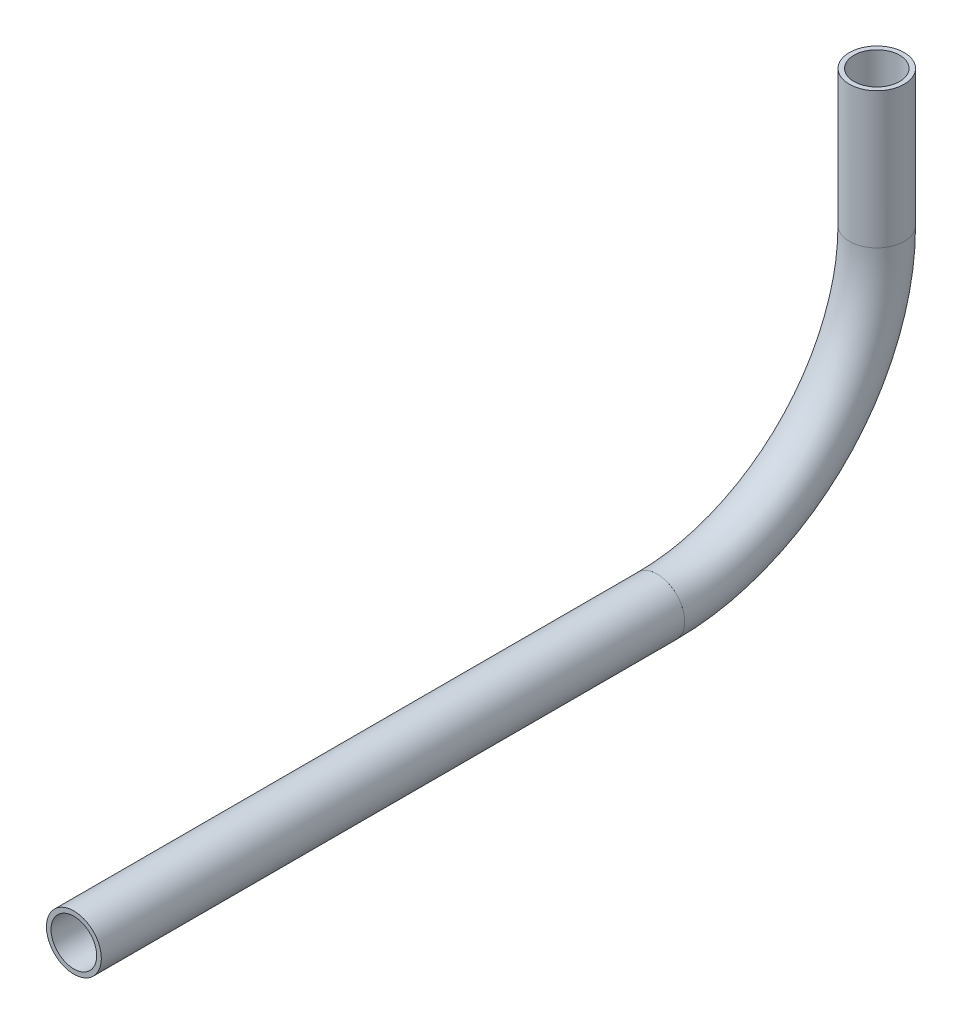
ISO-10303-21;
HEADER;
FILE_DESCRIPTION(('STEP AP214'),'2;1');
FILE_NAME('part.step','',(''),(''),'','','');
FILE_SCHEMA(('AUTOMOTIVE_DESIGN { 1 0 10303 214 1 1 1 1 }'));
ENDSEC;
DATA;
#1=APPLICATION_CONTEXT('core data for automotive mechanical design processes');
#2=APPLICATION_PROTOCOL_DEFINITION('international standard','automotive_design',2000,#1);
#3=PRODUCT_CONTEXT('',#1,'mechanical');
#4=PRODUCT('Part','Part','',(#3));
#5=PRODUCT_RELATED_PRODUCT_CATEGORY('part','',(#4));
#6=PRODUCT_DEFINITION_FORMATION('','',#4);
#7=PRODUCT_DEFINITION_CONTEXT('part definition',#1,'design');
#8=PRODUCT_DEFINITION('design','',#6,#7);
#9=PRODUCT_DEFINITION_SHAPE('','',#8);
#10=(LENGTH_UNIT() NAMED_UNIT(*) SI_UNIT(.MILLI.,.METRE.));
#11=(NAMED_UNIT(*) PLANE_ANGLE_UNIT() SI_UNIT($,.RADIAN.));
#12=(NAMED_UNIT(*) SI_UNIT($,.STERADIAN.) SOLID_ANGLE_UNIT());
#13=UNCERTAINTY_MEASURE_WITH_UNIT(LENGTH_MEASURE(1.E-05),#10,'distance_accuracy_value','');
#14=(GEOMETRIC_REPRESENTATION_CONTEXT(3) GLOBAL_UNCERTAINTY_ASSIGNED_CONTEXT((#13)) GLOBAL_UNIT_ASSIGNED_CONTEXT((#10,
#11,#12)) REPRESENTATION_CONTEXT('',''));
#15=CARTESIAN_POINT('',(0.,0.,0.));
#16=DIRECTION('',(0.,0.,1.));
#17=DIRECTION('',(1.,0.,0.));
#18=AXIS2_PLACEMENT_3D('',#15,#16,#17);
#19=CARTESIAN_POINT('',(0.,670.165576631268,168.173580131087));
#20=DIRECTION('',(0.,0.,1.));
#21=DIRECTION('',(0.,-1.,0.));
#22=AXIS2_PLACEMENT_3D('',#19,#20,#21);
#23=CYLINDRICAL_SURFACE('',#22,5.28320000000004);
#24=CARTESIAN_POINT('',(0.,670.165576631268,303.16459571102));
#25=DIRECTION('',(0.,0.,-1.));
#26=DIRECTION('',(0.,1.,0.));
#27=AXIS2_PLACEMENT_3D('',#24,#25,#26);
#28=CIRCLE('',#27,5.28320000000004);
#29=CARTESIAN_POINT('',(0.,675.448776631268,303.16459571102));
#30=VERTEX_POINT('',#29);
#31=EDGE_CURVE('E61',#30,#30,#28,.T.);
#32=ORIENTED_EDGE('',*,*,#31,.F.);
#33=EDGE_LOOP('',(#32));
#34=FACE_BOUND('',#33,.T.);
#35=CARTESIAN_POINT('',(0.,670.165576631268,168.173580131087));
#36=DIRECTION('',(0.,0.,-1.));
#37=DIRECTION('',(0.,1.,0.));
#38=AXIS2_PLACEMENT_3D('',#35,#36,#37);
#39=CIRCLE('',#38,5.28320000000004);
#40=CARTESIAN_POINT('',(0.,675.448776631268,168.173580131087));
#41=VERTEX_POINT('',#40);
#42=EDGE_CURVE('E57',#41,#41,#39,.T.);
#43=ORIENTED_EDGE('',*,*,#42,.T.);
#44=EDGE_LOOP('',(#43));
#45=FACE_BOUND('',#44,.T.);
#46=ADVANCED_FACE('F53',(#34,#45),#23,.F.);
#47=CARTESIAN_POINT('',(0.,670.165576631268,168.173580131087));
#48=DIRECTION('',(0.,0.,1.));
#49=DIRECTION('',(0.,-1.,0.));
#50=AXIS2_PLACEMENT_3D('',#47,#48,#49);
#51=CYLINDRICAL_SURFACE('',#50,6.35000000000005);
#52=CARTESIAN_POINT('',(0.,670.165576631268,303.16459571102));
#53=DIRECTION('',(0.,0.,-1.));
#54=DIRECTION('',(0.,1.,0.));
#55=AXIS2_PLACEMENT_3D('',#52,#53,#54);
#56=CIRCLE('',#55,6.35000000000005);
#57=CARTESIAN_POINT('',(0.,676.515576631268,303.16459571102));
#58=VERTEX_POINT('',#57);
#59=EDGE_CURVE('E65',#58,#58,#56,.T.);
#60=ORIENTED_EDGE('',*,*,#59,.T.);
#61=EDGE_LOOP('',(#60));
#62=FACE_BOUND('',#61,.T.);
#63=CARTESIAN_POINT('',(0.,670.165576631268,168.173580131087));
#64=DIRECTION('',(0.,0.,-1.));
#65=DIRECTION('',(0.,1.,0.));
#66=AXIS2_PLACEMENT_3D('',#63,#64,#65);
#67=CIRCLE('',#66,6.35000000000005);
#68=CARTESIAN_POINT('',(0.,676.515576631268,168.173580131087));
#69=VERTEX_POINT('',#68);
#70=EDGE_CURVE('E12',#69,#69,#67,.T.);
#71=ORIENTED_EDGE('',*,*,#70,.F.);
#72=EDGE_LOOP('',(#71));
#73=FACE_BOUND('',#72,.T.);
#74=ADVANCED_FACE('F80',(#62,#73),#51,.T.);
#75=CARTESIAN_POINT('',(0.,670.165576631268,303.16459571102));
#76=DIRECTION('',(0.,0.,-1.));
#77=DIRECTION('',(0.,1.,0.));
#78=AXIS2_PLACEMENT_3D('',#75,#76,#77);
#79=PLANE('',#78);
#80=ORIENTED_EDGE('',*,*,#31,.T.);
#81=EDGE_LOOP('',(#80));
#82=FACE_BOUND('',#81,.T.);
#83=ORIENTED_EDGE('',*,*,#59,.F.);
#84=EDGE_LOOP('',(#83));
#85=FACE_BOUND('',#84,.T.);
#86=ADVANCED_FACE('F76',(#82,#85),#79,.F.);
#87=CARTESIAN_POINT('',(0.,670.165576631268,168.173580131087));
#88=DIRECTION('',(0.,0.,-1.));
#89=DIRECTION('',(0.,1.,0.));
#90=AXIS2_PLACEMENT_3D('',#87,#88,#89);
#91=PLANE('',#90);
#92=ORIENTED_EDGE('',*,*,#42,.F.);
#93=EDGE_LOOP('',(#92));
#94=FACE_BOUND('',#93,.T.);
#95=ORIENTED_EDGE('',*,*,#70,.T.);
#96=EDGE_LOOP('',(#95));
#97=FACE_BOUND('',#96,.T.);
#98=ADVANCED_FACE('F55',(#94,#97),#91,.T.);
#99=CLOSED_SHELL('',(#46,#74,#86,#98));
#100=MANIFOLD_SOLID_BREP('B2',#99);
#101=CARTESIAN_POINT('',(0.,720.965576631268,168.173580131087));
#102=DIRECTION('',(-1.,0.,0.));
#103=DIRECTION('',(0.,0.,1.));
#104=AXIS2_PLACEMENT_3D('',#101,#102,#103);
#105=TOROIDAL_SURFACE('',#104,50.8000000000001,5.28320000000004);
#106=CARTESIAN_POINT('',(0.,720.965576631268,117.373580131087));
#107=DIRECTION('',(0.,1.,0.));
#108=DIRECTION('',(0.,0.,1.));
#109=AXIS2_PLACEMENT_3D('',#106,#107,#108);
#110=CIRCLE('',#109,5.28320000000004);
#111=CARTESIAN_POINT('',(0.,720.965576631268,112.090380131087));
#112=VERTEX_POINT('',#111);
#113=EDGE_CURVE('E164',#112,#112,#110,.T.);
#114=CARTESIAN_POINT('',(0.,670.165576631268,168.173580131087));
#115=DIRECTION('',(0.,0.,1.));
#116=DIRECTION('',(0.,-1.,0.));
#117=AXIS2_PLACEMENT_3D('',#114,#115,#116);
#118=CIRCLE('',#117,5.28320000000004);
#119=CARTESIAN_POINT('',(0.,664.882376631268,168.173580131087));
#120=VERTEX_POINT('',#119);
#121=EDGE_CURVE('E154',#120,#120,#118,.T.);
#122=CARTESIAN_POINT('',(0.,720.965576631268,168.173580131087));
#123=DIRECTION('',(-1.,0.,0.));
#124=DIRECTION('',(0.,0.,1.));
#125=AXIS2_PLACEMENT_3D('',#122,#123,#124);
#126=CIRCLE('',#125,56.0832000000001);
#127=EDGE_CURVE('',#112,#120,#126,.T.);
#128=ORIENTED_EDGE('',*,*,#113,.T.);
#129=ORIENTED_EDGE('',*,*,#121,.T.);
#130=ORIENTED_EDGE('',*,*,#127,.T.);
#131=ORIENTED_EDGE('',*,*,#127,.F.);
#132=EDGE_LOOP('',(#128,#130,#129,#131));
#133=FACE_BOUND('',#132,.T.);
#134=ADVANCED_FACE('F150',(#133),#105,.F.);
#135=CARTESIAN_POINT('',(0.,720.965576631268,168.173580131087));
#136=DIRECTION('',(-1.,0.,0.));
#137=DIRECTION('',(0.,0.,1.));
#138=AXIS2_PLACEMENT_3D('',#135,#136,#137);
#139=TOROIDAL_SURFACE('',#138,50.8000000000001,6.35000000000005);
#140=CARTESIAN_POINT('',(0.,720.965576631268,117.373580131087));
#141=DIRECTION('',(0.,1.,0.));
#142=DIRECTION('',(0.,0.,1.));
#143=AXIS2_PLACEMENT_3D('',#140,#141,#142);
#144=CIRCLE('',#143,6.35000000000005);
#145=CARTESIAN_POINT('',(0.,720.965576631268,111.023580131087));
#146=VERTEX_POINT('',#145);
#147=EDGE_CURVE('E158',#146,#146,#144,.T.);
#148=CARTESIAN_POINT('',(0.,670.165576631268,168.173580131087));
#149=DIRECTION('',(0.,0.,1.));
#150=DIRECTION('',(0.,-1.,0.));
#151=AXIS2_PLACEMENT_3D('',#148,#149,#150);
#152=CIRCLE('',#151,6.35000000000005);
#153=CARTESIAN_POINT('',(0.,663.815576631268,168.173580131087));
#154=VERTEX_POINT('',#153);
#155=EDGE_CURVE('E52',#154,#154,#152,.T.);
#156=CARTESIAN_POINT('',(0.,720.965576631268,168.173580131087));
#157=DIRECTION('',(-1.,0.,0.));
#158=DIRECTION('',(0.,0.,1.));
#159=AXIS2_PLACEMENT_3D('',#156,#157,#158);
#160=CIRCLE('',#159,57.1500000000001);
#161=EDGE_CURVE('',#146,#154,#160,.T.);
#162=ORIENTED_EDGE('',*,*,#147,.F.);
#163=ORIENTED_EDGE('',*,*,#155,.F.);
#164=ORIENTED_EDGE('',*,*,#161,.T.);
#165=ORIENTED_EDGE('',*,*,#161,.F.);
#166=EDGE_LOOP('',(#162,#164,#163,#165));
#167=FACE_BOUND('',#166,.T.);
#168=ADVANCED_FACE('F177',(#167),#139,.T.);
#169=CARTESIAN_POINT('',(0.,720.965576631268,117.373580131087));
#170=DIRECTION('',(0.,1.,0.));
#171=DIRECTION('',(0.,0.,1.));
#172=AXIS2_PLACEMENT_3D('',#169,#170,#171);
#173=PLANE('',#172);
#174=ORIENTED_EDGE('',*,*,#113,.F.);
#175=EDGE_LOOP('',(#174));
#176=FACE_BOUND('',#175,.T.);
#177=ORIENTED_EDGE('',*,*,#147,.T.);
#178=EDGE_LOOP('',(#177));
#179=FACE_BOUND('',#178,.T.);
#180=ADVANCED_FACE('F173',(#176,#179),#173,.T.);
#181=CARTESIAN_POINT('',(0.,670.165576631268,168.173580131087));
#182=DIRECTION('',(0.,0.,1.));
#183=DIRECTION('',(0.,-1.,0.));
#184=AXIS2_PLACEMENT_3D('',#181,#182,#183);
#185=PLANE('',#184);
#186=ORIENTED_EDGE('',*,*,#121,.F.);
#187=EDGE_LOOP('',(#186));
#188=FACE_BOUND('',#187,.T.);
#189=ORIENTED_EDGE('',*,*,#155,.T.);
#190=EDGE_LOOP('',(#189));
#191=FACE_BOUND('',#190,.T.);
#192=ADVANCED_FACE('F152',(#188,#191),#185,.T.);
#193=CLOSED_SHELL('',(#134,#168,#180,#192));
#194=MANIFOLD_SOLID_BREP('B7',#193);
#195=CARTESIAN_POINT('',(0.,752.458618261262,117.373580131087));
#196=DIRECTION('',(0.,-1.,0.));
#197=DIRECTION('',(0.,0.,-1.));
#198=AXIS2_PLACEMENT_3D('',#195,#196,#197);
#199=CYLINDRICAL_SURFACE('',#198,5.28320000000004);
#200=CARTESIAN_POINT('',(0.,752.458618261262,117.373580131087));
#201=DIRECTION('',(0.,1.,0.));
#202=DIRECTION('',(0.,0.,1.));
#203=AXIS2_PLACEMENT_3D('',#200,#201,#202);
#204=CIRCLE('',#203,5.28320000000004);
#205=CARTESIAN_POINT('',(0.,752.458618261262,122.656780131087));
#206=VERTEX_POINT('',#205);
#207=EDGE_CURVE('E252',#206,#206,#204,.T.);
#208=ORIENTED_EDGE('',*,*,#207,.T.);
#209=EDGE_LOOP('',(#208));
#210=FACE_BOUND('',#209,.T.);
#211=CARTESIAN_POINT('',(0.,720.965576631268,117.373580131087));
#212=DIRECTION('',(0.,-1.,0.));
#213=DIRECTION('',(0.,0.,-1.));
#214=AXIS2_PLACEMENT_3D('',#211,#212,#213);
#215=CIRCLE('',#214,5.28320000000004);
#216=CARTESIAN_POINT('',(0.,720.965576631268,112.090380131087));
#217=VERTEX_POINT('',#216);
#218=EDGE_CURVE('E242',#217,#217,#215,.T.);
#219=ORIENTED_EDGE('',*,*,#218,.T.);
#220=EDGE_LOOP('',(#219));
#221=FACE_BOUND('',#220,.T.);
#222=ADVANCED_FACE('F238',(#210,#221),#199,.F.);
#223=CARTESIAN_POINT('',(0.,752.458618261262,117.373580131087));
#224=DIRECTION('',(0.,-1.,0.));
#225=DIRECTION('',(0.,0.,-1.));
#226=AXIS2_PLACEMENT_3D('',#223,#224,#225);
#227=CYLINDRICAL_SURFACE('',#226,6.35000000000005);
#228=CARTESIAN_POINT('',(0.,752.458618261262,117.373580131087));
#229=DIRECTION('',(0.,1.,0.));
#230=DIRECTION('',(0.,0.,1.));
#231=AXIS2_PLACEMENT_3D('',#228,#229,#230);
#232=CIRCLE('',#231,6.35000000000005);
#233=CARTESIAN_POINT('',(0.,752.458618261262,123.723580131087));
#234=VERTEX_POINT('',#233);
#235=EDGE_CURVE('E246',#234,#234,#232,.T.);
#236=ORIENTED_EDGE('',*,*,#235,.F.);
#237=EDGE_LOOP('',(#236));
#238=FACE_BOUND('',#237,.T.);
#239=CARTESIAN_POINT('',(0.,720.965576631268,117.373580131087));
#240=DIRECTION('',(0.,-1.,0.));
#241=DIRECTION('',(0.,0.,-1.));
#242=AXIS2_PLACEMENT_3D('',#239,#240,#241);
#243=CIRCLE('',#242,6.35000000000005);
#244=CARTESIAN_POINT('',(0.,720.965576631268,111.023580131087));
#245=VERTEX_POINT('',#244);
#246=EDGE_CURVE('E149',#245,#245,#243,.T.);
#247=ORIENTED_EDGE('',*,*,#246,.F.);
#248=EDGE_LOOP('',(#247));
#249=FACE_BOUND('',#248,.T.);
#250=ADVANCED_FACE('F265',(#238,#249),#227,.T.);
#251=CARTESIAN_POINT('',(0.,752.458618261262,117.373580131087));
#252=DIRECTION('',(0.,1.,0.));
#253=DIRECTION('',(0.,0.,1.));
#254=AXIS2_PLACEMENT_3D('',#251,#252,#253);
#255=PLANE('',#254);
#256=ORIENTED_EDGE('',*,*,#207,.F.);
#257=EDGE_LOOP('',(#256));
#258=FACE_BOUND('',#257,.T.);
#259=ORIENTED_EDGE('',*,*,#235,.T.);
#260=EDGE_LOOP('',(#259));
#261=FACE_BOUND('',#260,.T.);
#262=ADVANCED_FACE('F261',(#258,#261),#255,.T.);
#263=CARTESIAN_POINT('',(0.,720.965576631268,117.373580131087));
#264=DIRECTION('',(0.,-1.,0.));
#265=DIRECTION('',(0.,0.,-1.));
#266=AXIS2_PLACEMENT_3D('',#263,#264,#265);
#267=PLANE('',#266);
#268=ORIENTED_EDGE('',*,*,#218,.F.);
#269=EDGE_LOOP('',(#268));
#270=FACE_BOUND('',#269,.T.);
#271=ORIENTED_EDGE('',*,*,#246,.T.);
#272=EDGE_LOOP('',(#271));
#273=FACE_BOUND('',#272,.T.);
#274=ADVANCED_FACE('F240',(#270,#273),#267,.T.);
#275=CLOSED_SHELL('',(#222,#250,#262,#274));
#276=MANIFOLD_SOLID_BREP('B47',#275);
#277=ADVANCED_BREP_SHAPE_REPRESENTATION('',(#18,#100,#194,#276),#14);
#278=SHAPE_DEFINITION_REPRESENTATION(#9,#277);
ENDSEC;
END-ISO-10303-21;
